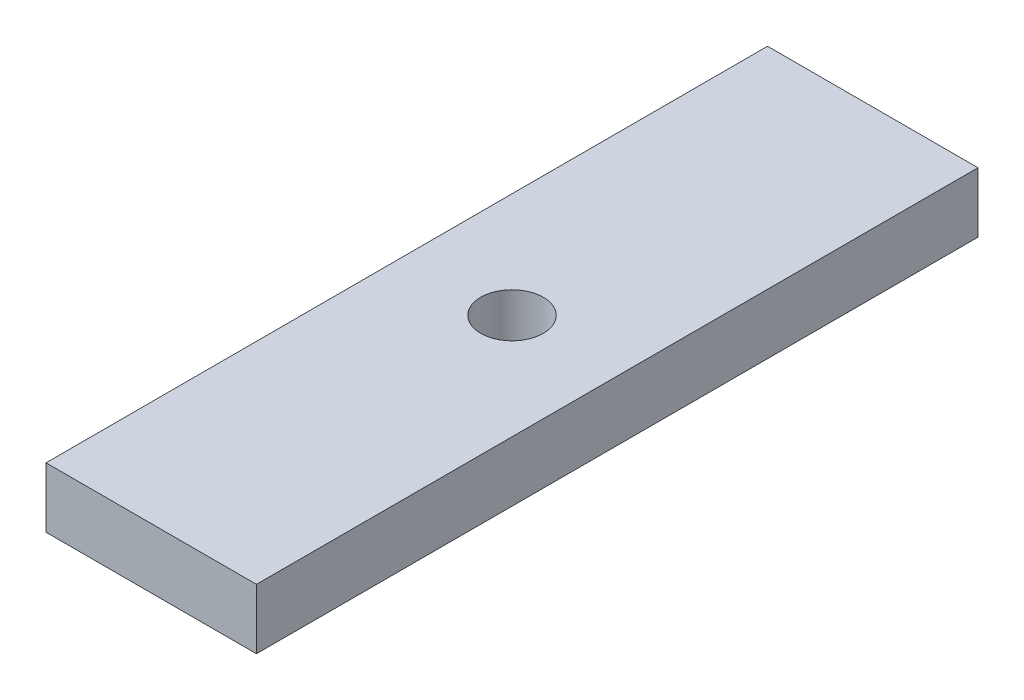
ISO-10303-21;
HEADER;
FILE_DESCRIPTION(('STEP AP214'),'2;1');
FILE_NAME('part.step','',(''),(''),'','','');
FILE_SCHEMA(('AUTOMOTIVE_DESIGN { 1 0 10303 214 1 1 1 1 }'));
ENDSEC;
DATA;
#1=APPLICATION_CONTEXT('core data for automotive mechanical design processes');
#2=APPLICATION_PROTOCOL_DEFINITION('international standard','automotive_design',2000,#1);
#3=PRODUCT_CONTEXT('',#1,'mechanical');
#4=PRODUCT('Part','Part','',(#3));
#5=PRODUCT_RELATED_PRODUCT_CATEGORY('part','',(#4));
#6=PRODUCT_DEFINITION_FORMATION('','',#4);
#7=PRODUCT_DEFINITION_CONTEXT('part definition',#1,'design');
#8=PRODUCT_DEFINITION('design','',#6,#7);
#9=PRODUCT_DEFINITION_SHAPE('','',#8);
#10=(LENGTH_UNIT() NAMED_UNIT(*) SI_UNIT(.MILLI.,.METRE.));
#11=(NAMED_UNIT(*) PLANE_ANGLE_UNIT() SI_UNIT($,.RADIAN.));
#12=(NAMED_UNIT(*) SI_UNIT($,.STERADIAN.) SOLID_ANGLE_UNIT());
#13=UNCERTAINTY_MEASURE_WITH_UNIT(LENGTH_MEASURE(1.E-05),#10,'distance_accuracy_value','');
#14=(GEOMETRIC_REPRESENTATION_CONTEXT(3) GLOBAL_UNCERTAINTY_ASSIGNED_CONTEXT((#13)) GLOBAL_UNIT_ASSIGNED_CONTEXT((#10,
#11,#12)) REPRESENTATION_CONTEXT('',''));
#15=CARTESIAN_POINT('',(0.,0.,0.));
#16=DIRECTION('',(0.,0.,1.));
#17=DIRECTION('',(1.,0.,0.));
#18=AXIS2_PLACEMENT_3D('',#15,#16,#17);
#19=CARTESIAN_POINT('',(0.,10.,0.));
#20=DIRECTION('',(0.,0.,-1.));
#21=DIRECTION('',(-1.,0.,0.));
#22=AXIS2_PLACEMENT_3D('',#19,#20,#21);
#23=PLANE('',#22);
#24=DIRECTION('',(1.,0.,0.));
#25=VECTOR('',#24,1.);
#26=CARTESIAN_POINT('',(0.,0.,0.));
#27=LINE('',#26,#25);
#28=CARTESIAN_POINT('',(0.,0.,0.));
#29=VERTEX_POINT('',#28);
#30=CARTESIAN_POINT('',(35.,0.,0.));
#31=VERTEX_POINT('',#30);
#32=EDGE_CURVE('E102',#29,#31,#27,.T.);
#33=ORIENTED_EDGE('',*,*,#32,.T.);
#34=DIRECTION('',(0.,-1.,0.));
#35=VECTOR('',#34,1.);
#36=CARTESIAN_POINT('',(35.,10.,0.));
#37=LINE('',#36,#35);
#38=CARTESIAN_POINT('',(35.,10.,0.));
#39=VERTEX_POINT('',#38);
#40=EDGE_CURVE('E11',#39,#31,#37,.T.);
#41=ORIENTED_EDGE('',*,*,#40,.F.);
#42=DIRECTION('',(1.,0.,0.));
#43=VECTOR('',#42,1.);
#44=CARTESIAN_POINT('',(0.,10.,0.));
#45=LINE('',#44,#43);
#46=CARTESIAN_POINT('',(0.,10.,0.));
#47=VERTEX_POINT('',#46);
#48=EDGE_CURVE('E87',#47,#39,#45,.T.);
#49=ORIENTED_EDGE('',*,*,#48,.F.);
#50=DIRECTION('',(0.,-1.,0.));
#51=VECTOR('',#50,1.);
#52=CARTESIAN_POINT('',(0.,10.,0.));
#53=LINE('',#52,#51);
#54=EDGE_CURVE('E101',#47,#29,#53,.T.);
#55=ORIENTED_EDGE('',*,*,#54,.T.);
#56=EDGE_LOOP('',(#33,#41,#49,#55));
#57=FACE_BOUND('',#56,.T.);
#58=ADVANCED_FACE('F35',(#57),#23,.F.);
#59=CARTESIAN_POINT('',(35.,10.,0.));
#60=DIRECTION('',(-1.,0.,0.));
#61=DIRECTION('',(0.,0.,1.));
#62=AXIS2_PLACEMENT_3D('',#59,#60,#61);
#63=PLANE('',#62);
#64=DIRECTION('',(0.,0.,-1.));
#65=VECTOR('',#64,1.);
#66=CARTESIAN_POINT('',(35.,0.,0.));
#67=LINE('',#66,#65);
#68=CARTESIAN_POINT('',(35.,0.,-120.));
#69=VERTEX_POINT('',#68);
#70=EDGE_CURVE('E91',#31,#69,#67,.T.);
#71=ORIENTED_EDGE('',*,*,#70,.T.);
#72=DIRECTION('',(0.,-1.,0.));
#73=VECTOR('',#72,1.);
#74=CARTESIAN_POINT('',(35.,10.,-120.));
#75=LINE('',#74,#73);
#76=CARTESIAN_POINT('',(35.,10.,-120.));
#77=VERTEX_POINT('',#76);
#78=EDGE_CURVE('E43',#77,#69,#75,.T.);
#79=ORIENTED_EDGE('',*,*,#78,.F.);
#80=DIRECTION('',(0.,0.,-1.));
#81=VECTOR('',#80,1.);
#82=CARTESIAN_POINT('',(35.,10.,0.));
#83=LINE('',#82,#81);
#84=EDGE_CURVE('E81',#39,#77,#83,.T.);
#85=ORIENTED_EDGE('',*,*,#84,.F.);
#86=ORIENTED_EDGE('',*,*,#40,.T.);
#87=EDGE_LOOP('',(#71,#79,#85,#86));
#88=FACE_BOUND('',#87,.T.);
#89=ADVANCED_FACE('F90',(#88),#63,.F.);
#90=CARTESIAN_POINT('',(0.,10.,-120.));
#91=DIRECTION('',(0.,0.,1.));
#92=DIRECTION('',(1.,0.,0.));
#93=AXIS2_PLACEMENT_3D('',#90,#91,#92);
#94=PLANE('',#93);
#95=DIRECTION('',(-1.,0.,0.));
#96=VECTOR('',#95,1.);
#97=CARTESIAN_POINT('',(0.,0.,-120.));
#98=LINE('',#97,#96);
#99=CARTESIAN_POINT('',(0.,0.,-120.));
#100=VERTEX_POINT('',#99);
#101=EDGE_CURVE('E68',#69,#100,#98,.T.);
#102=ORIENTED_EDGE('',*,*,#101,.T.);
#103=DIRECTION('',(0.,-1.,0.));
#104=VECTOR('',#103,1.);
#105=CARTESIAN_POINT('',(0.,10.,-120.));
#106=LINE('',#105,#104);
#107=CARTESIAN_POINT('',(0.,10.,-120.));
#108=VERTEX_POINT('',#107);
#109=EDGE_CURVE('E92',#108,#100,#106,.T.);
#110=ORIENTED_EDGE('',*,*,#109,.F.);
#111=DIRECTION('',(-1.,0.,0.));
#112=VECTOR('',#111,1.);
#113=CARTESIAN_POINT('',(0.,10.,-120.));
#114=LINE('',#113,#112);
#115=EDGE_CURVE('E85',#77,#108,#114,.T.);
#116=ORIENTED_EDGE('',*,*,#115,.F.);
#117=ORIENTED_EDGE('',*,*,#78,.T.);
#118=EDGE_LOOP('',(#102,#110,#116,#117));
#119=FACE_BOUND('',#118,.T.);
#120=ADVANCED_FACE('F93',(#119),#94,.F.);
#121=CARTESIAN_POINT('',(0.,10.,0.));
#122=DIRECTION('',(1.,0.,0.));
#123=DIRECTION('',(0.,0.,-1.));
#124=AXIS2_PLACEMENT_3D('',#121,#122,#123);
#125=PLANE('',#124);
#126=DIRECTION('',(0.,0.,1.));
#127=VECTOR('',#126,1.);
#128=CARTESIAN_POINT('',(0.,0.,0.));
#129=LINE('',#128,#127);
#130=EDGE_CURVE('E74',#100,#29,#129,.T.);
#131=ORIENTED_EDGE('',*,*,#130,.T.);
#132=ORIENTED_EDGE('',*,*,#54,.F.);
#133=DIRECTION('',(0.,0.,1.));
#134=VECTOR('',#133,1.);
#135=CARTESIAN_POINT('',(0.,10.,0.));
#136=LINE('',#135,#134);
#137=EDGE_CURVE('E51',#108,#47,#136,.T.);
#138=ORIENTED_EDGE('',*,*,#137,.F.);
#139=ORIENTED_EDGE('',*,*,#109,.T.);
#140=EDGE_LOOP('',(#131,#132,#138,#139));
#141=FACE_BOUND('',#140,.T.);
#142=ADVANCED_FACE('F112',(#141),#125,.F.);
#143=CARTESIAN_POINT('',(17.5,10.,-60.));
#144=DIRECTION('',(0.,-1.,0.));
#145=DIRECTION('',(0.,0.,-1.));
#146=AXIS2_PLACEMENT_3D('',#143,#144,#145);
#147=CYLINDRICAL_SURFACE('',#146,5.20579920870659);
#148=CARTESIAN_POINT('',(17.5,10.,-60.));
#149=DIRECTION('',(0.,1.,0.));
#150=DIRECTION('',(0.,0.,1.));
#151=AXIS2_PLACEMENT_3D('',#148,#149,#150);
#152=CIRCLE('',#151,5.20579920870659);
#153=CARTESIAN_POINT('',(17.5,10.,-54.7942007912934));
#154=VERTEX_POINT('',#153);
#155=EDGE_CURVE('E95',#154,#154,#152,.T.);
#156=ORIENTED_EDGE('',*,*,#155,.T.);
#157=EDGE_LOOP('',(#156));
#158=FACE_BOUND('',#157,.T.);
#159=CARTESIAN_POINT('',(17.5,0.,-60.));
#160=DIRECTION('',(0.,1.,0.));
#161=DIRECTION('',(0.,0.,1.));
#162=AXIS2_PLACEMENT_3D('',#159,#160,#161);
#163=CIRCLE('',#162,5.20579920870659);
#164=CARTESIAN_POINT('',(17.5,0.,-54.7942007912934));
#165=VERTEX_POINT('',#164);
#166=EDGE_CURVE('E108',#165,#165,#163,.T.);
#167=ORIENTED_EDGE('',*,*,#166,.F.);
#168=EDGE_LOOP('',(#167));
#169=FACE_BOUND('',#168,.T.);
#170=ADVANCED_FACE('F129',(#158,#169),#147,.F.);
#171=CARTESIAN_POINT('',(0.,10.,0.));
#172=DIRECTION('',(0.,1.,0.));
#173=DIRECTION('',(0.,0.,1.));
#174=AXIS2_PLACEMENT_3D('',#171,#172,#173);
#175=PLANE('',#174);
#176=ORIENTED_EDGE('',*,*,#48,.T.);
#177=ORIENTED_EDGE('',*,*,#84,.T.);
#178=ORIENTED_EDGE('',*,*,#115,.T.);
#179=ORIENTED_EDGE('',*,*,#137,.T.);
#180=EDGE_LOOP('',(#176,#177,#178,#179));
#181=FACE_BOUND('',#180,.T.);
#182=ORIENTED_EDGE('',*,*,#155,.F.);
#183=EDGE_LOOP('',(#182));
#184=FACE_BOUND('',#183,.T.);
#185=ADVANCED_FACE('F82',(#181,#184),#175,.T.);
#186=CARTESIAN_POINT('',(0.,0.,0.));
#187=DIRECTION('',(0.,1.,0.));
#188=DIRECTION('',(0.,0.,1.));
#189=AXIS2_PLACEMENT_3D('',#186,#187,#188);
#190=PLANE('',#189);
#191=ORIENTED_EDGE('',*,*,#32,.F.);
#192=ORIENTED_EDGE('',*,*,#130,.F.);
#193=ORIENTED_EDGE('',*,*,#101,.F.);
#194=ORIENTED_EDGE('',*,*,#70,.F.);
#195=EDGE_LOOP('',(#191,#192,#193,#194));
#196=FACE_BOUND('',#195,.T.);
#197=ORIENTED_EDGE('',*,*,#166,.T.);
#198=EDGE_LOOP('',(#197));
#199=FACE_BOUND('',#198,.T.);
#200=ADVANCED_FACE('F115',(#196,#199),#190,.F.);
#201=CLOSED_SHELL('',(#58,#89,#120,#142,#170,#185,#200));
#202=MANIFOLD_SOLID_BREP('B2',#201);
#203=ADVANCED_BREP_SHAPE_REPRESENTATION('',(#18,#202),#14);
#204=SHAPE_DEFINITION_REPRESENTATION(#9,#203);
ENDSEC;
END-ISO-10303-21;
